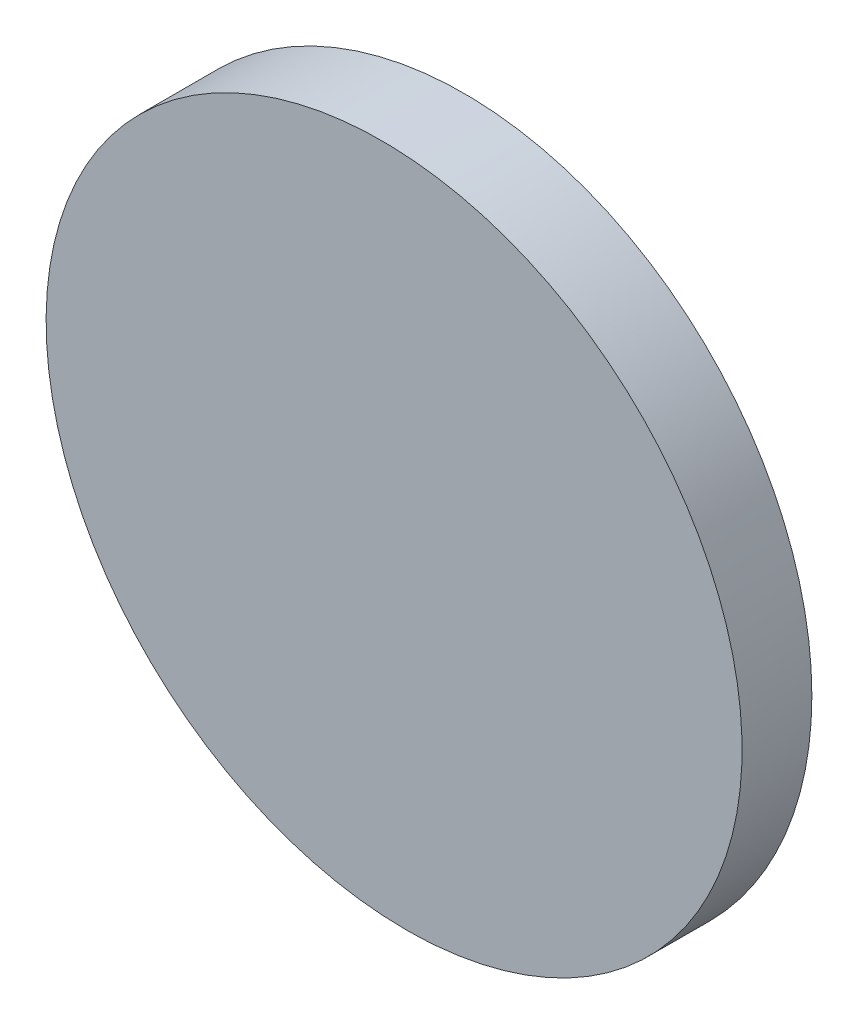
ISO-10303-21;
HEADER;
FILE_DESCRIPTION(('STEP AP214'),'2;1');
FILE_NAME('part.step','',(''),(''),'','','');
FILE_SCHEMA(('AUTOMOTIVE_DESIGN { 1 0 10303 214 1 1 1 1 }'));
ENDSEC;
DATA;
#1=APPLICATION_CONTEXT('core data for automotive mechanical design processes');
#2=APPLICATION_PROTOCOL_DEFINITION('international standard','automotive_design',2000,#1);
#3=PRODUCT_CONTEXT('',#1,'mechanical');
#4=PRODUCT('Part','Part','',(#3));
#5=PRODUCT_RELATED_PRODUCT_CATEGORY('part','',(#4));
#6=PRODUCT_DEFINITION_FORMATION('','',#4);
#7=PRODUCT_DEFINITION_CONTEXT('part definition',#1,'design');
#8=PRODUCT_DEFINITION('design','',#6,#7);
#9=PRODUCT_DEFINITION_SHAPE('','',#8);
#10=(LENGTH_UNIT() NAMED_UNIT(*) SI_UNIT(.MILLI.,.METRE.));
#11=(NAMED_UNIT(*) PLANE_ANGLE_UNIT() SI_UNIT($,.RADIAN.));
#12=(NAMED_UNIT(*) SI_UNIT($,.STERADIAN.) SOLID_ANGLE_UNIT());
#13=UNCERTAINTY_MEASURE_WITH_UNIT(LENGTH_MEASURE(1.E-05),#10,'distance_accuracy_value','');
#14=(GEOMETRIC_REPRESENTATION_CONTEXT(3) GLOBAL_UNCERTAINTY_ASSIGNED_CONTEXT((#13)) GLOBAL_UNIT_ASSIGNED_CONTEXT((#10,
#11,#12)) REPRESENTATION_CONTEXT('',''));
#15=CARTESIAN_POINT('',(0.,0.,0.));
#16=DIRECTION('',(0.,0.,1.));
#17=DIRECTION('',(1.,0.,0.));
#18=AXIS2_PLACEMENT_3D('',#15,#16,#17);
#19=CARTESIAN_POINT('',(0.,0.,6.));
#20=DIRECTION('',(0.,0.,-1.));
#21=DIRECTION('',(-1.,0.,0.));
#22=AXIS2_PLACEMENT_3D('',#19,#20,#21);
#23=CYLINDRICAL_SURFACE('',#22,25.4);
#24=CARTESIAN_POINT('',(0.,0.,5.11301245490941));
#25=DIRECTION('',(0.,0.0348994967025087,-0.999390827019095));
#26=DIRECTION('',(0.,-0.999390827019095,-0.0348994967025087));
#27=AXIS2_PLACEMENT_3D('',#24,#25,#26);
#28=ELLIPSE('',#27,25.4154824251901,25.4);
#29=CARTESIAN_POINT('',(0.,-25.4,4.22602490981882));
#30=VERTEX_POINT('',#29);
#31=EDGE_CURVE('E39',#30,#30,#28,.T.);
#32=ORIENTED_EDGE('',*,*,#31,.T.);
#33=EDGE_LOOP('',(#32));
#34=FACE_BOUND('',#33,.T.);
#35=CARTESIAN_POINT('',(0.,0.,0.));
#36=DIRECTION('',(0.,0.,1.));
#37=DIRECTION('',(1.,0.,0.));
#38=AXIS2_PLACEMENT_3D('',#35,#36,#37);
#39=CIRCLE('',#38,25.4);
#40=CARTESIAN_POINT('',(25.4,0.,0.));
#41=VERTEX_POINT('',#40);
#42=EDGE_CURVE('E10',#41,#41,#39,.T.);
#43=ORIENTED_EDGE('',*,*,#42,.T.);
#44=EDGE_LOOP('',(#43));
#45=FACE_BOUND('',#44,.T.);
#46=ADVANCED_FACE('F33',(#34,#45),#23,.T.);
#47=CARTESIAN_POINT('',(0.,0.,0.));
#48=DIRECTION('',(0.,0.,1.));
#49=DIRECTION('',(1.,0.,0.));
#50=AXIS2_PLACEMENT_3D('',#47,#48,#49);
#51=PLANE('',#50);
#52=ORIENTED_EDGE('',*,*,#42,.F.);
#53=EDGE_LOOP('',(#52));
#54=FACE_BOUND('',#53,.T.);
#55=ADVANCED_FACE('F48',(#54),#51,.F.);
#56=CARTESIAN_POINT('',(-50.,-25.4316775948569,4.22491870383077));
#57=DIRECTION('',(0.,0.0348994967025087,-0.999390827019095));
#58=DIRECTION('',(0.,0.999390827019095,0.0348994967025087));
#59=AXIS2_PLACEMENT_3D('',#56,#57,#58);
#60=PLANE('',#59);
#61=ORIENTED_EDGE('',*,*,#31,.F.);
#62=EDGE_LOOP('',(#61));
#63=FACE_BOUND('',#62,.T.);
#64=ADVANCED_FACE('F46',(#63),#60,.F.);
#65=CLOSED_SHELL('',(#46,#55,#64));
#66=MANIFOLD_SOLID_BREP('B2',#65);
#67=ADVANCED_BREP_SHAPE_REPRESENTATION('',(#18,#66),#14);
#68=SHAPE_DEFINITION_REPRESENTATION(#9,#67);
ENDSEC;
END-ISO-10303-21;
